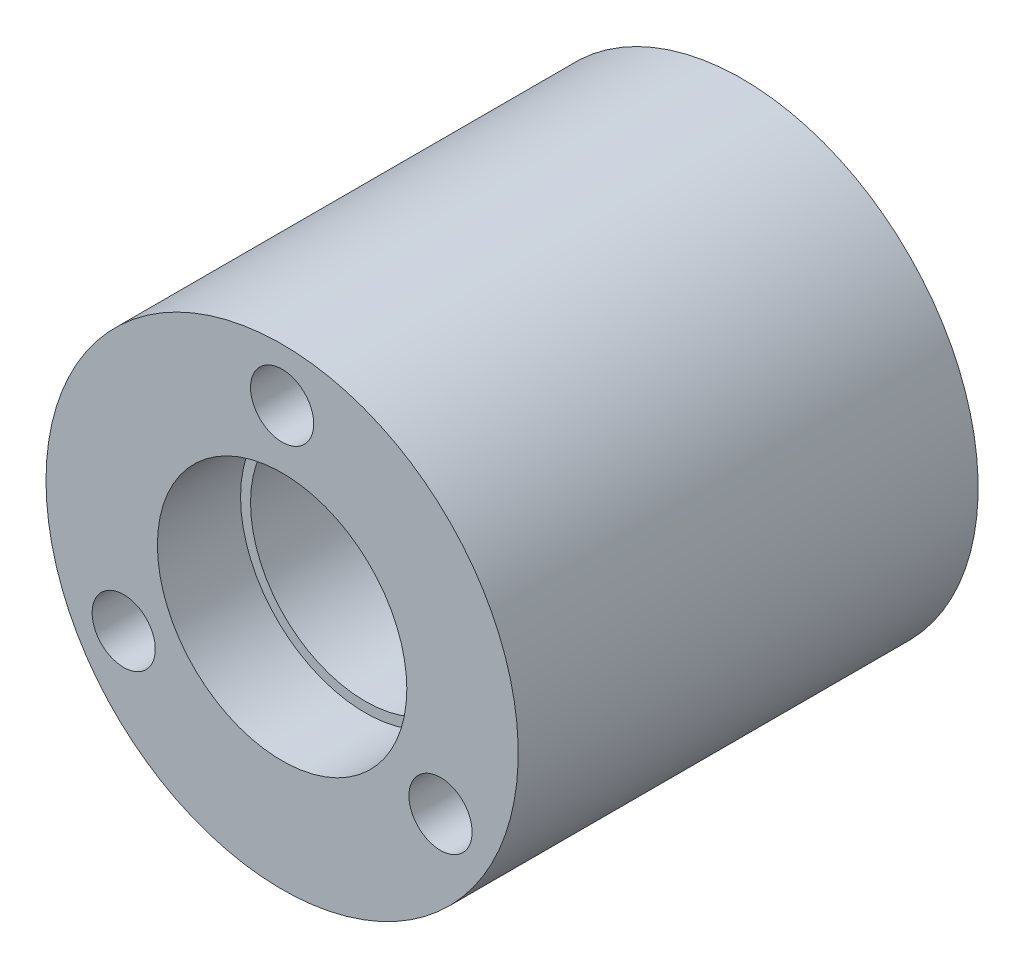
ISO-10303-21;
HEADER;
FILE_DESCRIPTION(('STEP AP214'),'2;1');
FILE_NAME('part.step','',(''),(''),'','','');
FILE_SCHEMA(('AUTOMOTIVE_DESIGN { 1 0 10303 214 1 1 1 1 }'));
ENDSEC;
DATA;
#1=APPLICATION_CONTEXT('core data for automotive mechanical design processes');
#2=APPLICATION_PROTOCOL_DEFINITION('international standard','automotive_design',2000,#1);
#3=PRODUCT_CONTEXT('',#1,'mechanical');
#4=PRODUCT('Part','Part','',(#3));
#5=PRODUCT_RELATED_PRODUCT_CATEGORY('part','',(#4));
#6=PRODUCT_DEFINITION_FORMATION('','',#4);
#7=PRODUCT_DEFINITION_CONTEXT('part definition',#1,'design');
#8=PRODUCT_DEFINITION('design','',#6,#7);
#9=PRODUCT_DEFINITION_SHAPE('','',#8);
#10=(LENGTH_UNIT() NAMED_UNIT(*) SI_UNIT(.MILLI.,.METRE.));
#11=(NAMED_UNIT(*) PLANE_ANGLE_UNIT() SI_UNIT($,.RADIAN.));
#12=(NAMED_UNIT(*) SI_UNIT($,.STERADIAN.) SOLID_ANGLE_UNIT());
#13=UNCERTAINTY_MEASURE_WITH_UNIT(LENGTH_MEASURE(1.E-05),#10,'distance_accuracy_value','');
#14=(GEOMETRIC_REPRESENTATION_CONTEXT(3) GLOBAL_UNCERTAINTY_ASSIGNED_CONTEXT((#13)) GLOBAL_UNIT_ASSIGNED_CONTEXT((#10,
#11,#12)) REPRESENTATION_CONTEXT('',''));
#15=CARTESIAN_POINT('',(0.,0.,0.));
#16=DIRECTION('',(0.,0.,1.));
#17=DIRECTION('',(1.,0.,0.));
#18=AXIS2_PLACEMENT_3D('',#15,#16,#17);
#19=CARTESIAN_POINT('',(0.,0.,1.79705));
#20=DIRECTION('',(0.,0.,1.));
#21=DIRECTION('',(-1.,0.,0.));
#22=AXIS2_PLACEMENT_3D('',#19,#20,#21);
#23=CYLINDRICAL_SURFACE('',#22,4.3815);
#24=CARTESIAN_POINT('',(0.,0.,5.60705));
#25=DIRECTION('',(0.,0.,-1.));
#26=DIRECTION('',(-1.,0.,0.));
#27=AXIS2_PLACEMENT_3D('',#24,#25,#26);
#28=CIRCLE('',#27,4.3815);
#29=CARTESIAN_POINT('',(-4.3815,0.,5.60705));
#30=VERTEX_POINT('',#29);
#31=EDGE_CURVE('E73',#30,#30,#28,.F.);
#32=ORIENTED_EDGE('',*,*,#31,.T.);
#33=EDGE_LOOP('',(#32));
#34=FACE_BOUND('',#33,.T.);
#35=CARTESIAN_POINT('',(0.,0.,1.79705));
#36=DIRECTION('',(0.,0.,-1.));
#37=DIRECTION('',(-1.,0.,0.));
#38=AXIS2_PLACEMENT_3D('',#35,#36,#37);
#39=CIRCLE('',#38,4.3815);
#40=CARTESIAN_POINT('',(-4.3815,0.,1.79705));
#41=VERTEX_POINT('',#40);
#42=EDGE_CURVE('E40',#41,#41,#39,.T.);
#43=ORIENTED_EDGE('',*,*,#42,.T.);
#44=EDGE_LOOP('',(#43));
#45=FACE_BOUND('',#44,.T.);
#46=ADVANCED_FACE('F37',(#34,#45),#23,.F.);
#47=CARTESIAN_POINT('',(0.,0.,1.79705));
#48=DIRECTION('',(0.,0.,1.));
#49=DIRECTION('',(-1.,0.,0.));
#50=AXIS2_PLACEMENT_3D('',#47,#48,#49);
#51=PLANE('',#50);
#52=ORIENTED_EDGE('',*,*,#42,.F.);
#53=EDGE_LOOP('',(#52));
#54=FACE_BOUND('',#53,.T.);
#55=CARTESIAN_POINT('',(0.,0.,1.79705));
#56=DIRECTION('',(0.,0.,1.));
#57=DIRECTION('',(1.,0.,0.));
#58=AXIS2_PLACEMENT_3D('',#55,#56,#57);
#59=CIRCLE('',#58,2.2225);
#60=CARTESIAN_POINT('',(2.2225,0.,1.79705));
#61=VERTEX_POINT('',#60);
#62=EDGE_CURVE('E67',#61,#61,#59,.T.);
#63=ORIENTED_EDGE('',*,*,#62,.F.);
#64=EDGE_LOOP('',(#63));
#65=FACE_BOUND('',#64,.T.);
#66=ADVANCED_FACE('F60',(#54,#65),#51,.T.);
#67=CARTESIAN_POINT('',(0.,6.985,-0.737869999966279));
#68=DIRECTION('',(0.,0.,1.));
#69=DIRECTION('',(0.,1.,0.));
#70=AXIS2_PLACEMENT_3D('',#67,#68,#69);
#71=CONICAL_SURFACE('',#70,1.20650000002342,1.08210413625789);
#72=CARTESIAN_POINT('',(0.,6.985,-1.37794999994867));
#73=VERTEX_POINT('',#72);
#74=VERTEX_LOOP('',#73);
#75=FACE_BOUND('',#74,.T.);
#76=CARTESIAN_POINT('',(0.,6.985,-0.737870000000002));
#77=DIRECTION('',(0.,0.,-1.));
#78=DIRECTION('',(-1.,0.,0.));
#79=AXIS2_PLACEMENT_3D('',#76,#77,#78);
#80=CIRCLE('',#79,1.2065);
#81=CARTESIAN_POINT('',(-1.2065,6.985,-0.737870000000002));
#82=VERTEX_POINT('',#81);
#83=EDGE_CURVE('E64',#82,#82,#80,.T.);
#84=ORIENTED_EDGE('',*,*,#83,.F.);
#85=EDGE_LOOP('',(#84));
#86=FACE_BOUND('',#85,.T.);
#87=ADVANCED_FACE('F56',(#75,#86),#71,.F.);
#88=CARTESIAN_POINT('',(-6.04918744543432,-3.49249999999999,-0.737870000023122));
#89=DIRECTION('',(0.,0.,1.));
#90=DIRECTION('',(-1.,0.,0.));
#91=AXIS2_PLACEMENT_3D('',#88,#89,#90);
#92=CONICAL_SURFACE('',#91,1.20649999998784,1.08210413625789);
#93=CARTESIAN_POINT('',(-6.04918744542715,-3.49249999999999,-1.37795000000551));
#94=VERTEX_POINT('',#93);
#95=VERTEX_LOOP('',#94);
#96=FACE_BOUND('',#95,.T.);
#97=CARTESIAN_POINT('',(-6.04918744543432,-3.49249999999999,-0.737870000000006));
#98=DIRECTION('',(0.,0.,-1.));
#99=DIRECTION('',(-1.,0.,0.));
#100=AXIS2_PLACEMENT_3D('',#97,#98,#99);
#101=CIRCLE('',#100,1.2065);
#102=CARTESIAN_POINT('',(-7.25568744543431,-3.49249999999999,-0.737870000000006));
#103=VERTEX_POINT('',#102);
#104=EDGE_CURVE('E66',#103,#103,#101,.T.);
#105=ORIENTED_EDGE('',*,*,#104,.F.);
#106=EDGE_LOOP('',(#105));
#107=FACE_BOUND('',#106,.T.);
#108=ADVANCED_FACE('F59',(#96,#107),#92,.F.);
#109=CARTESIAN_POINT('',(6.04918744543431,-3.49249999999999,-0.737870000079965));
#110=DIRECTION('',(0.,0.,1.));
#111=DIRECTION('',(-1.,0.,0.));
#112=AXIS2_PLACEMENT_3D('',#109,#110,#111);
#113=CONICAL_SURFACE('',#112,1.20649999988848,1.08210413623598);
#114=CARTESIAN_POINT('',(6.04918744542715,-3.49249999999999,-1.37795000000551));
#115=VERTEX_POINT('',#114);
#116=VERTEX_LOOP('',#115);
#117=FACE_BOUND('',#116,.T.);
#118=CARTESIAN_POINT('',(6.04918744543431,-3.49249999999999,-0.737870000000009));
#119=DIRECTION('',(0.,0.,-1.));
#120=DIRECTION('',(-1.,0.,0.));
#121=AXIS2_PLACEMENT_3D('',#118,#119,#120);
#122=CIRCLE('',#121,1.2065);
#123=CARTESIAN_POINT('',(4.84268744543431,-3.49249999999999,-0.737870000000009));
#124=VERTEX_POINT('',#123);
#125=EDGE_CURVE('E70',#124,#124,#122,.T.);
#126=ORIENTED_EDGE('',*,*,#125,.F.);
#127=EDGE_LOOP('',(#126));
#128=FACE_BOUND('',#127,.T.);
#129=ADVANCED_FACE('F119',(#117,#128),#113,.F.);
#130=CARTESIAN_POINT('',(0.,0.,5.60705));
#131=DIRECTION('',(0.,0.,1.));
#132=DIRECTION('',(-1.,0.,0.));
#133=AXIS2_PLACEMENT_3D('',#130,#131,#132);
#134=PLANE('',#133);
#135=CARTESIAN_POINT('',(0.,0.,5.60705));
#136=DIRECTION('',(0.,0.,-1.));
#137=DIRECTION('',(-1.,0.,0.));
#138=AXIS2_PLACEMENT_3D('',#135,#136,#137);
#139=CIRCLE('',#138,4.7625);
#140=CARTESIAN_POINT('',(-4.7625,0.,5.60705));
#141=VERTEX_POINT('',#140);
#142=EDGE_CURVE('E94',#141,#141,#139,.T.);
#143=ORIENTED_EDGE('',*,*,#142,.F.);
#144=EDGE_LOOP('',(#143));
#145=FACE_BOUND('',#144,.T.);
#146=ORIENTED_EDGE('',*,*,#31,.F.);
#147=EDGE_LOOP('',(#146));
#148=FACE_BOUND('',#147,.T.);
#149=ADVANCED_FACE('F110',(#145,#148),#134,.T.);
#150=CARTESIAN_POINT('',(0.,0.,8.78205));
#151=DIRECTION('',(0.,0.,-1.));
#152=DIRECTION('',(1.,0.,0.));
#153=AXIS2_PLACEMENT_3D('',#150,#151,#152);
#154=CYLINDRICAL_SURFACE('',#153,2.2225);
#155=CARTESIAN_POINT('',(0.,0.,-8.78205));
#156=DIRECTION('',(0.,0.,1.));
#157=DIRECTION('',(1.,0.,0.));
#158=AXIS2_PLACEMENT_3D('',#155,#156,#157);
#159=CIRCLE('',#158,2.2225);
#160=CARTESIAN_POINT('',(2.2225,0.,-8.78205));
#161=VERTEX_POINT('',#160);
#162=EDGE_CURVE('E91',#161,#161,#159,.F.);
#163=ORIENTED_EDGE('',*,*,#162,.T.);
#164=EDGE_LOOP('',(#163));
#165=FACE_BOUND('',#164,.T.);
#166=ORIENTED_EDGE('',*,*,#62,.T.);
#167=EDGE_LOOP('',(#166));
#168=FACE_BOUND('',#167,.T.);
#169=ADVANCED_FACE('F107',(#165,#168),#154,.F.);
#170=CARTESIAN_POINT('',(0.,6.985,-1.37795));
#171=DIRECTION('',(0.,0.,1.));
#172=DIRECTION('',(-1.,0.,0.));
#173=AXIS2_PLACEMENT_3D('',#170,#171,#172);
#174=CYLINDRICAL_SURFACE('',#173,1.2065);
#175=ORIENTED_EDGE('',*,*,#83,.T.);
#176=EDGE_LOOP('',(#175));
#177=FACE_BOUND('',#176,.T.);
#178=CARTESIAN_POINT('',(0.,6.985,8.78205));
#179=DIRECTION('',(0.,0.,-1.));
#180=DIRECTION('',(-1.,0.,0.));
#181=AXIS2_PLACEMENT_3D('',#178,#179,#180);
#182=CIRCLE('',#181,1.2065);
#183=CARTESIAN_POINT('',(-1.2065,6.985,8.78205));
#184=VERTEX_POINT('',#183);
#185=EDGE_CURVE('E88',#184,#184,#182,.T.);
#186=ORIENTED_EDGE('',*,*,#185,.F.);
#187=EDGE_LOOP('',(#186));
#188=FACE_BOUND('',#187,.T.);
#189=ADVANCED_FACE('F109',(#177,#188),#174,.F.);
#190=CARTESIAN_POINT('',(-6.04918744543432,-3.49249999999999,-1.37795));
#191=DIRECTION('',(0.,0.,1.));
#192=DIRECTION('',(-1.,0.,0.));
#193=AXIS2_PLACEMENT_3D('',#190,#191,#192);
#194=CYLINDRICAL_SURFACE('',#193,1.2065);
#195=ORIENTED_EDGE('',*,*,#104,.T.);
#196=EDGE_LOOP('',(#195));
#197=FACE_BOUND('',#196,.T.);
#198=CARTESIAN_POINT('',(-6.04918744543432,-3.49249999999999,8.78205));
#199=DIRECTION('',(0.,0.,-1.));
#200=DIRECTION('',(-1.,0.,0.));
#201=AXIS2_PLACEMENT_3D('',#198,#199,#200);
#202=CIRCLE('',#201,1.2065);
#203=CARTESIAN_POINT('',(-7.25568744543431,-3.49249999999999,8.78205));
#204=VERTEX_POINT('',#203);
#205=EDGE_CURVE('E85',#204,#204,#202,.T.);
#206=ORIENTED_EDGE('',*,*,#205,.F.);
#207=EDGE_LOOP('',(#206));
#208=FACE_BOUND('',#207,.T.);
#209=ADVANCED_FACE('F117',(#197,#208),#194,.F.);
#210=CARTESIAN_POINT('',(6.04918744543431,-3.49249999999999,-1.37795));
#211=DIRECTION('',(0.,0.,1.));
#212=DIRECTION('',(-1.,0.,0.));
#213=AXIS2_PLACEMENT_3D('',#210,#211,#212);
#214=CYLINDRICAL_SURFACE('',#213,1.2065);
#215=ORIENTED_EDGE('',*,*,#125,.T.);
#216=EDGE_LOOP('',(#215));
#217=FACE_BOUND('',#216,.T.);
#218=CARTESIAN_POINT('',(6.04918744543431,-3.49249999999999,8.78205));
#219=DIRECTION('',(0.,0.,-1.));
#220=DIRECTION('',(-1.,0.,0.));
#221=AXIS2_PLACEMENT_3D('',#218,#219,#220);
#222=CIRCLE('',#221,1.2065);
#223=CARTESIAN_POINT('',(4.84268744543431,-3.49249999999999,8.78205));
#224=VERTEX_POINT('',#223);
#225=EDGE_CURVE('E82',#224,#224,#222,.T.);
#226=ORIENTED_EDGE('',*,*,#225,.F.);
#227=EDGE_LOOP('',(#226));
#228=FACE_BOUND('',#227,.T.);
#229=ADVANCED_FACE('F168',(#217,#228),#214,.F.);
#230=CARTESIAN_POINT('',(0.,0.,5.60705));
#231=DIRECTION('',(0.,0.,1.));
#232=DIRECTION('',(-1.,0.,0.));
#233=AXIS2_PLACEMENT_3D('',#230,#231,#232);
#234=CYLINDRICAL_SURFACE('',#233,4.7625);
#235=ORIENTED_EDGE('',*,*,#142,.T.);
#236=EDGE_LOOP('',(#235));
#237=FACE_BOUND('',#236,.T.);
#238=CARTESIAN_POINT('',(0.,0.,8.78205));
#239=DIRECTION('',(0.,0.,-1.));
#240=DIRECTION('',(-1.,0.,0.));
#241=AXIS2_PLACEMENT_3D('',#238,#239,#240);
#242=CIRCLE('',#241,4.7625);
#243=CARTESIAN_POINT('',(-4.7625,0.,8.78205));
#244=VERTEX_POINT('',#243);
#245=EDGE_CURVE('E79',#244,#244,#242,.T.);
#246=ORIENTED_EDGE('',*,*,#245,.F.);
#247=EDGE_LOOP('',(#246));
#248=FACE_BOUND('',#247,.T.);
#249=ADVANCED_FACE('F178',(#237,#248),#234,.F.);
#250=CARTESIAN_POINT('',(0.,0.,-8.78205));
#251=DIRECTION('',(0.,0.,-1.));
#252=DIRECTION('',(1.,0.,0.));
#253=AXIS2_PLACEMENT_3D('',#250,#251,#252);
#254=PLANE('',#253);
#255=CARTESIAN_POINT('',(0.,0.,-8.78205));
#256=DIRECTION('',(0.,0.,-1.));
#257=DIRECTION('',(-1.,0.,0.));
#258=AXIS2_PLACEMENT_3D('',#255,#256,#257);
#259=CIRCLE('',#258,9.017);
#260=CARTESIAN_POINT('',(-9.017,0.,-8.78205));
#261=VERTEX_POINT('',#260);
#262=EDGE_CURVE('E46',#261,#261,#259,.T.);
#263=ORIENTED_EDGE('',*,*,#262,.T.);
#264=EDGE_LOOP('',(#263));
#265=FACE_BOUND('',#264,.T.);
#266=ORIENTED_EDGE('',*,*,#162,.F.);
#267=EDGE_LOOP('',(#266));
#268=FACE_BOUND('',#267,.T.);
#269=ADVANCED_FACE('F188',(#265,#268),#254,.T.);
#270=CARTESIAN_POINT('',(0.,0.,8.78205));
#271=DIRECTION('',(0.,0.,-1.));
#272=DIRECTION('',(1.,0.,0.));
#273=AXIS2_PLACEMENT_3D('',#270,#271,#272);
#274=PLANE('',#273);
#275=CARTESIAN_POINT('',(0.,0.,8.78205));
#276=DIRECTION('',(0.,0.,-1.));
#277=DIRECTION('',(-1.,0.,0.));
#278=AXIS2_PLACEMENT_3D('',#275,#276,#277);
#279=CIRCLE('',#278,9.017);
#280=CARTESIAN_POINT('',(-9.017,0.,8.78205));
#281=VERTEX_POINT('',#280);
#282=EDGE_CURVE('E11',#281,#281,#279,.F.);
#283=ORIENTED_EDGE('',*,*,#282,.T.);
#284=EDGE_LOOP('',(#283));
#285=FACE_BOUND('',#284,.T.);
#286=ORIENTED_EDGE('',*,*,#245,.T.);
#287=EDGE_LOOP('',(#286));
#288=FACE_BOUND('',#287,.T.);
#289=ORIENTED_EDGE('',*,*,#225,.T.);
#290=EDGE_LOOP('',(#289));
#291=FACE_BOUND('',#290,.T.);
#292=ORIENTED_EDGE('',*,*,#205,.T.);
#293=EDGE_LOOP('',(#292));
#294=FACE_BOUND('',#293,.T.);
#295=ORIENTED_EDGE('',*,*,#185,.T.);
#296=EDGE_LOOP('',(#295));
#297=FACE_BOUND('',#296,.T.);
#298=ADVANCED_FACE('F198',(#285,#288,#291,#294,#297),#274,.F.);
#299=CARTESIAN_POINT('',(0.,0.,-8.78205));
#300=DIRECTION('',(0.,0.,1.));
#301=DIRECTION('',(-1.,0.,0.));
#302=AXIS2_PLACEMENT_3D('',#299,#300,#301);
#303=CYLINDRICAL_SURFACE('',#302,9.017);
#304=ORIENTED_EDGE('',*,*,#282,.F.);
#305=EDGE_LOOP('',(#304));
#306=FACE_BOUND('',#305,.T.);
#307=ORIENTED_EDGE('',*,*,#262,.F.);
#308=EDGE_LOOP('',(#307));
#309=FACE_BOUND('',#308,.T.);
#310=ADVANCED_FACE('F208',(#306,#309),#303,.T.);
#311=CLOSED_SHELL('',(#46,#66,#87,#108,#129,#149,#169,#189,#209,#229,#249,#269,#298,#310));
#312=MANIFOLD_SOLID_BREP('B2',#311);
#313=ADVANCED_BREP_SHAPE_REPRESENTATION('',(#18,#312),#14);
#314=SHAPE_DEFINITION_REPRESENTATION(#9,#313);
ENDSEC;
END-ISO-10303-21;
